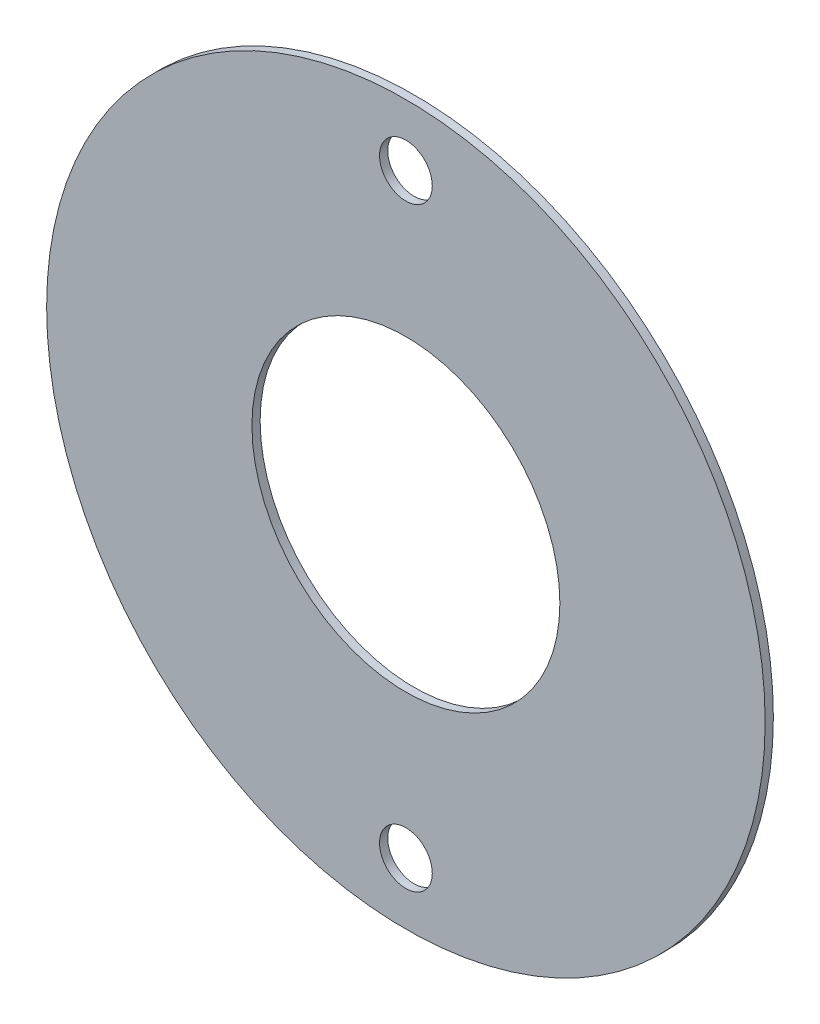
ISO-10303-21;
HEADER;
FILE_DESCRIPTION(('STEP AP214'),'2;1');
FILE_NAME('part.step','',(''),(''),'','','');
FILE_SCHEMA(('AUTOMOTIVE_DESIGN { 1 0 10303 214 1 1 1 1 }'));
ENDSEC;
DATA;
#1=APPLICATION_CONTEXT('core data for automotive mechanical design processes');
#2=APPLICATION_PROTOCOL_DEFINITION('international standard','automotive_design',2000,#1);
#3=PRODUCT_CONTEXT('',#1,'mechanical');
#4=PRODUCT('Part','Part','',(#3));
#5=PRODUCT_RELATED_PRODUCT_CATEGORY('part','',(#4));
#6=PRODUCT_DEFINITION_FORMATION('','',#4);
#7=PRODUCT_DEFINITION_CONTEXT('part definition',#1,'design');
#8=PRODUCT_DEFINITION('design','',#6,#7);
#9=PRODUCT_DEFINITION_SHAPE('','',#8);
#10=(LENGTH_UNIT() NAMED_UNIT(*) SI_UNIT(.MILLI.,.METRE.));
#11=(NAMED_UNIT(*) PLANE_ANGLE_UNIT() SI_UNIT($,.RADIAN.));
#12=(NAMED_UNIT(*) SI_UNIT($,.STERADIAN.) SOLID_ANGLE_UNIT());
#13=UNCERTAINTY_MEASURE_WITH_UNIT(LENGTH_MEASURE(1.E-05),#10,'distance_accuracy_value','');
#14=(GEOMETRIC_REPRESENTATION_CONTEXT(3) GLOBAL_UNCERTAINTY_ASSIGNED_CONTEXT((#13)) GLOBAL_UNIT_ASSIGNED_CONTEXT((#10,
#11,#12)) REPRESENTATION_CONTEXT('',''));
#15=CARTESIAN_POINT('',(0.,0.,0.));
#16=DIRECTION('',(0.,0.,1.));
#17=DIRECTION('',(1.,0.,0.));
#18=AXIS2_PLACEMENT_3D('',#15,#16,#17);
#19=CARTESIAN_POINT('',(0.,0.,0.508));
#20=DIRECTION('',(0.,0.,-1.));
#21=DIRECTION('',(-1.,0.,0.));
#22=AXIS2_PLACEMENT_3D('',#19,#20,#21);
#23=CYLINDRICAL_SURFACE('',#22,22.225);
#24=CARTESIAN_POINT('',(0.,0.,0.508));
#25=DIRECTION('',(0.,0.,1.));
#26=DIRECTION('',(1.,0.,0.));
#27=AXIS2_PLACEMENT_3D('',#24,#25,#26);
#28=CIRCLE('',#27,22.225);
#29=CARTESIAN_POINT('',(22.225,0.,0.508));
#30=VERTEX_POINT('',#29);
#31=EDGE_CURVE('E10',#30,#30,#28,.T.);
#32=ORIENTED_EDGE('',*,*,#31,.F.);
#33=EDGE_LOOP('',(#32));
#34=FACE_BOUND('',#33,.T.);
#35=CARTESIAN_POINT('',(0.,0.,0.));
#36=DIRECTION('',(0.,0.,1.));
#37=DIRECTION('',(1.,0.,0.));
#38=AXIS2_PLACEMENT_3D('',#35,#36,#37);
#39=CIRCLE('',#38,22.225);
#40=CARTESIAN_POINT('',(22.225,0.,0.));
#41=VERTEX_POINT('',#40);
#42=EDGE_CURVE('E36',#41,#41,#39,.T.);
#43=ORIENTED_EDGE('',*,*,#42,.T.);
#44=EDGE_LOOP('',(#43));
#45=FACE_BOUND('',#44,.T.);
#46=ADVANCED_FACE('F33',(#34,#45),#23,.T.);
#47=CARTESIAN_POINT('',(0.,0.,0.508));
#48=DIRECTION('',(0.,0.,1.));
#49=DIRECTION('',(1.,0.,0.));
#50=AXIS2_PLACEMENT_3D('',#47,#48,#49);
#51=PLANE('',#50);
#52=CARTESIAN_POINT('',(0.,-18.415,0.508));
#53=DIRECTION('',(0.,0.,1.));
#54=DIRECTION('',(1.,0.,0.));
#55=AXIS2_PLACEMENT_3D('',#52,#53,#54);
#56=CIRCLE('',#55,1.63195);
#57=CARTESIAN_POINT('',(1.63195,-18.415,0.508));
#58=VERTEX_POINT('',#57);
#59=EDGE_CURVE('E59',#58,#58,#56,.T.);
#60=ORIENTED_EDGE('',*,*,#59,.F.);
#61=EDGE_LOOP('',(#60));
#62=FACE_BOUND('',#61,.T.);
#63=CARTESIAN_POINT('',(0.,18.415,0.508));
#64=DIRECTION('',(0.,0.,1.));
#65=DIRECTION('',(1.,0.,0.));
#66=AXIS2_PLACEMENT_3D('',#63,#64,#65);
#67=CIRCLE('',#66,1.63195);
#68=CARTESIAN_POINT('',(1.63195,18.415,0.508));
#69=VERTEX_POINT('',#68);
#70=EDGE_CURVE('E53',#69,#69,#67,.T.);
#71=ORIENTED_EDGE('',*,*,#70,.F.);
#72=EDGE_LOOP('',(#71));
#73=FACE_BOUND('',#72,.T.);
#74=CARTESIAN_POINT('',(0.,0.,0.508));
#75=DIRECTION('',(0.,0.,1.));
#76=DIRECTION('',(1.,0.,0.));
#77=AXIS2_PLACEMENT_3D('',#74,#75,#76);
#78=CIRCLE('',#77,9.525);
#79=CARTESIAN_POINT('',(9.525,0.,0.508));
#80=VERTEX_POINT('',#79);
#81=EDGE_CURVE('E45',#80,#80,#78,.T.);
#82=ORIENTED_EDGE('',*,*,#81,.F.);
#83=EDGE_LOOP('',(#82));
#84=FACE_BOUND('',#83,.T.);
#85=ORIENTED_EDGE('',*,*,#31,.T.);
#86=EDGE_LOOP('',(#85));
#87=FACE_BOUND('',#86,.T.);
#88=ADVANCED_FACE('F65',(#62,#73,#84,#87),#51,.T.);
#89=CARTESIAN_POINT('',(0.,0.,0.));
#90=DIRECTION('',(0.,0.,1.));
#91=DIRECTION('',(1.,0.,0.));
#92=AXIS2_PLACEMENT_3D('',#89,#90,#91);
#93=PLANE('',#92);
#94=CARTESIAN_POINT('',(0.,-18.415,0.));
#95=DIRECTION('',(0.,0.,1.));
#96=DIRECTION('',(1.,0.,0.));
#97=AXIS2_PLACEMENT_3D('',#94,#95,#96);
#98=CIRCLE('',#97,1.63195);
#99=CARTESIAN_POINT('',(1.63195,-18.415,0.));
#100=VERTEX_POINT('',#99);
#101=EDGE_CURVE('E56',#100,#100,#98,.T.);
#102=ORIENTED_EDGE('',*,*,#101,.T.);
#103=EDGE_LOOP('',(#102));
#104=FACE_BOUND('',#103,.T.);
#105=CARTESIAN_POINT('',(0.,18.415,0.));
#106=DIRECTION('',(0.,0.,1.));
#107=DIRECTION('',(1.,0.,0.));
#108=AXIS2_PLACEMENT_3D('',#105,#106,#107);
#109=CIRCLE('',#108,1.63195);
#110=CARTESIAN_POINT('',(1.63195,18.415,0.));
#111=VERTEX_POINT('',#110);
#112=EDGE_CURVE('E48',#111,#111,#109,.T.);
#113=ORIENTED_EDGE('',*,*,#112,.T.);
#114=EDGE_LOOP('',(#113));
#115=FACE_BOUND('',#114,.T.);
#116=CARTESIAN_POINT('',(0.,0.,0.));
#117=DIRECTION('',(0.,0.,1.));
#118=DIRECTION('',(1.,0.,0.));
#119=AXIS2_PLACEMENT_3D('',#116,#117,#118);
#120=CIRCLE('',#119,9.525);
#121=CARTESIAN_POINT('',(9.525,0.,0.));
#122=VERTEX_POINT('',#121);
#123=EDGE_CURVE('E43',#122,#122,#120,.T.);
#124=ORIENTED_EDGE('',*,*,#123,.T.);
#125=EDGE_LOOP('',(#124));
#126=FACE_BOUND('',#125,.T.);
#127=ORIENTED_EDGE('',*,*,#42,.F.);
#128=EDGE_LOOP('',(#127));
#129=FACE_BOUND('',#128,.T.);
#130=ADVANCED_FACE('F68',(#104,#115,#126,#129),#93,.F.);
#131=CARTESIAN_POINT('',(0.,0.,0.));
#132=DIRECTION('',(0.,0.,1.));
#133=DIRECTION('',(1.,0.,0.));
#134=AXIS2_PLACEMENT_3D('',#131,#132,#133);
#135=CYLINDRICAL_SURFACE('',#134,9.525);
#136=ORIENTED_EDGE('',*,*,#123,.F.);
#137=EDGE_LOOP('',(#136));
#138=FACE_BOUND('',#137,.T.);
#139=ORIENTED_EDGE('',*,*,#81,.T.);
#140=EDGE_LOOP('',(#139));
#141=FACE_BOUND('',#140,.T.);
#142=ADVANCED_FACE('F74',(#138,#141),#135,.F.);
#143=CARTESIAN_POINT('',(0.,18.415,0.508));
#144=DIRECTION('',(0.,0.,1.));
#145=DIRECTION('',(1.,0.,0.));
#146=AXIS2_PLACEMENT_3D('',#143,#144,#145);
#147=CYLINDRICAL_SURFACE('',#146,1.63195);
#148=ORIENTED_EDGE('',*,*,#112,.F.);
#149=EDGE_LOOP('',(#148));
#150=FACE_BOUND('',#149,.T.);
#151=ORIENTED_EDGE('',*,*,#70,.T.);
#152=EDGE_LOOP('',(#151));
#153=FACE_BOUND('',#152,.T.);
#154=ADVANCED_FACE('F76',(#150,#153),#147,.F.);
#155=CARTESIAN_POINT('',(0.,-18.415,0.508));
#156=DIRECTION('',(0.,0.,1.));
#157=DIRECTION('',(1.,0.,0.));
#158=AXIS2_PLACEMENT_3D('',#155,#156,#157);
#159=CYLINDRICAL_SURFACE('',#158,1.63195);
#160=ORIENTED_EDGE('',*,*,#101,.F.);
#161=EDGE_LOOP('',(#160));
#162=FACE_BOUND('',#161,.T.);
#163=ORIENTED_EDGE('',*,*,#59,.T.);
#164=EDGE_LOOP('',(#163));
#165=FACE_BOUND('',#164,.T.);
#166=ADVANCED_FACE('F63',(#162,#165),#159,.F.);
#167=CLOSED_SHELL('',(#46,#88,#130,#142,#154,#166));
#168=MANIFOLD_SOLID_BREP('B2',#167);
#169=ADVANCED_BREP_SHAPE_REPRESENTATION('',(#18,#168),#14);
#170=SHAPE_DEFINITION_REPRESENTATION(#9,#169);
ENDSEC;
END-ISO-10303-21;
